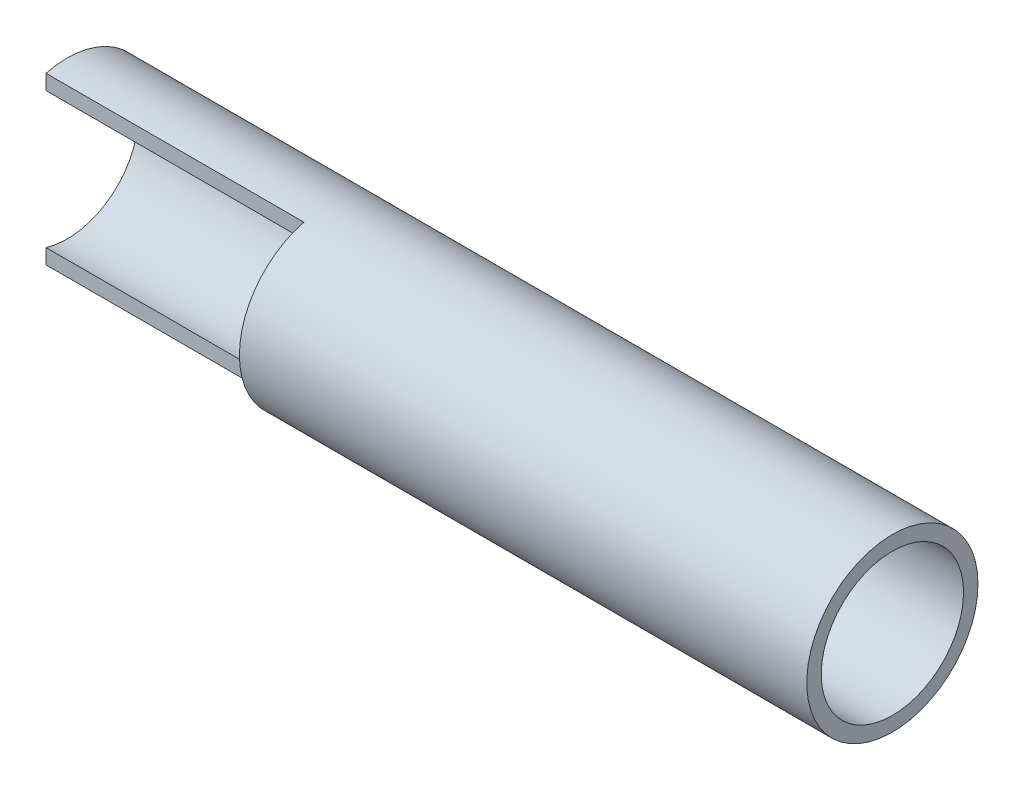
ISO-10303-21;
HEADER;
FILE_DESCRIPTION(('STEP AP214'),'2;1');
FILE_NAME('part.step','',(''),(''),'','','');
FILE_SCHEMA(('AUTOMOTIVE_DESIGN { 1 0 10303 214 1 1 1 1 }'));
ENDSEC;
DATA;
#1=APPLICATION_CONTEXT('core data for automotive mechanical design processes');
#2=APPLICATION_PROTOCOL_DEFINITION('international standard','automotive_design',2000,#1);
#3=PRODUCT_CONTEXT('',#1,'mechanical');
#4=PRODUCT('Part','Part','',(#3));
#5=PRODUCT_RELATED_PRODUCT_CATEGORY('part','',(#4));
#6=PRODUCT_DEFINITION_FORMATION('','',#4);
#7=PRODUCT_DEFINITION_CONTEXT('part definition',#1,'design');
#8=PRODUCT_DEFINITION('design','',#6,#7);
#9=PRODUCT_DEFINITION_SHAPE('','',#8);
#10=(LENGTH_UNIT() NAMED_UNIT(*) SI_UNIT(.MILLI.,.METRE.));
#11=(NAMED_UNIT(*) PLANE_ANGLE_UNIT() SI_UNIT($,.RADIAN.));
#12=(NAMED_UNIT(*) SI_UNIT($,.STERADIAN.) SOLID_ANGLE_UNIT());
#13=UNCERTAINTY_MEASURE_WITH_UNIT(LENGTH_MEASURE(1.E-05),#10,'distance_accuracy_value','');
#14=(GEOMETRIC_REPRESENTATION_CONTEXT(3) GLOBAL_UNCERTAINTY_ASSIGNED_CONTEXT((#13)) GLOBAL_UNIT_ASSIGNED_CONTEXT((#10,
#11,#12)) REPRESENTATION_CONTEXT('',''));
#15=CARTESIAN_POINT('',(0.,0.,0.));
#16=DIRECTION('',(0.,0.,1.));
#17=DIRECTION('',(1.,0.,0.));
#18=AXIS2_PLACEMENT_3D('',#15,#16,#17);
#19=CARTESIAN_POINT('',(-38.1,-21.082,21.082));
#20=DIRECTION('',(1.,0.,0.));
#21=DIRECTION('',(0.,0.,-1.));
#22=AXIS2_PLACEMENT_3D('',#19,#20,#21);
#23=PLANE('',#22);
#24=CARTESIAN_POINT('',(-38.1,0.,0.));
#25=DIRECTION('',(1.,0.,0.));
#26=DIRECTION('',(0.,0.,-1.));
#27=AXIS2_PLACEMENT_3D('',#24,#25,#26);
#28=CIRCLE('',#27,17.526);
#29=CARTESIAN_POINT('',(-38.1,16.7346295746276,5.20699999999984));
#30=VERTEX_POINT('',#29);
#31=CARTESIAN_POINT('',(-38.1,-16.7346295746281,5.207));
#32=VERTEX_POINT('',#31);
#33=EDGE_CURVE('E20',#30,#32,#28,.T.);
#34=ORIENTED_EDGE('',*,*,#33,.T.);
#35=DIRECTION('',(0.,1.,0.));
#36=VECTOR('',#35,1.);
#37=CARTESIAN_POINT('',(-38.1,-21.082,5.207));
#38=LINE('',#37,#36);
#39=CARTESIAN_POINT('',(-38.1,-20.4288490865247,5.20699999999991));
#40=VERTEX_POINT('',#39);
#41=EDGE_CURVE('E60',#32,#40,#38,.F.);
#42=ORIENTED_EDGE('',*,*,#41,.T.);
#43=CARTESIAN_POINT('',(-38.1,0.,0.));
#44=DIRECTION('',(1.,0.,0.));
#45=DIRECTION('',(0.,0.,-1.));
#46=AXIS2_PLACEMENT_3D('',#43,#44,#45);
#47=CIRCLE('',#46,21.082);
#48=CARTESIAN_POINT('',(-38.1,20.4288490865247,5.20699999999991));
#49=VERTEX_POINT('',#48);
#50=EDGE_CURVE('E118',#49,#40,#47,.T.);
#51=ORIENTED_EDGE('',*,*,#50,.F.);
#52=DIRECTION('',(0.,1.,0.));
#53=VECTOR('',#52,1.);
#54=CARTESIAN_POINT('',(-38.1,-21.082,5.207));
#55=LINE('',#54,#53);
#56=EDGE_CURVE('E55',#49,#30,#55,.F.);
#57=ORIENTED_EDGE('',*,*,#56,.T.);
#58=EDGE_LOOP('',(#34,#42,#51,#57));
#59=FACE_BOUND('',#58,.T.);
#60=ADVANCED_FACE('F17',(#59),#23,.F.);
#61=CARTESIAN_POINT('',(-38.1,-21.082,5.207));
#62=DIRECTION('',(0.,0.,-1.));
#63=DIRECTION('',(-1.,0.,0.));
#64=AXIS2_PLACEMENT_3D('',#61,#62,#63);
#65=PLANE('',#64);
#66=DIRECTION('',(0.,1.,0.));
#67=VECTOR('',#66,1.);
#68=CARTESIAN_POINT('',(-101.6,0.,5.207));
#69=LINE('',#68,#67);
#70=CARTESIAN_POINT('',(-101.6,20.4288490865247,5.20699999999991));
#71=VERTEX_POINT('',#70);
#72=CARTESIAN_POINT('',(-101.6,16.7346295746276,5.20699999999984));
#73=VERTEX_POINT('',#72);
#74=EDGE_CURVE('E117',#71,#73,#69,.F.);
#75=ORIENTED_EDGE('',*,*,#74,.T.);
#76=DIRECTION('',(1.,0.,0.));
#77=VECTOR('',#76,1.);
#78=CARTESIAN_POINT('',(-101.6,16.7346295746277,5.20699999999968));
#79=LINE('',#78,#77);
#80=EDGE_CURVE('E64',#73,#30,#79,.T.);
#81=ORIENTED_EDGE('',*,*,#80,.T.);
#82=ORIENTED_EDGE('',*,*,#56,.F.);
#83=DIRECTION('',(1.,0.,0.));
#84=VECTOR('',#83,1.);
#85=CARTESIAN_POINT('',(-101.6,20.4288490865247,5.20699999999982));
#86=LINE('',#85,#84);
#87=EDGE_CURVE('E113',#71,#49,#86,.T.);
#88=ORIENTED_EDGE('',*,*,#87,.F.);
#89=EDGE_LOOP('',(#75,#81,#82,#88));
#90=FACE_BOUND('',#89,.T.);
#91=ADVANCED_FACE('F116',(#90),#65,.F.);
#92=CARTESIAN_POINT('',(-38.1,-21.082,5.207));
#93=DIRECTION('',(0.,0.,-1.));
#94=DIRECTION('',(-1.,0.,0.));
#95=AXIS2_PLACEMENT_3D('',#92,#93,#94);
#96=PLANE('',#95);
#97=DIRECTION('',(0.,1.,0.));
#98=VECTOR('',#97,1.);
#99=CARTESIAN_POINT('',(-101.6,0.,5.207));
#100=LINE('',#99,#98);
#101=CARTESIAN_POINT('',(-101.6,-16.7346295746281,5.207));
#102=VERTEX_POINT('',#101);
#103=CARTESIAN_POINT('',(-101.6,-20.4288490865247,5.20699999999991));
#104=VERTEX_POINT('',#103);
#105=EDGE_CURVE('E121',#102,#104,#100,.F.);
#106=ORIENTED_EDGE('',*,*,#105,.T.);
#107=DIRECTION('',(1.,0.,0.));
#108=VECTOR('',#107,1.);
#109=CARTESIAN_POINT('',(-101.6,-20.4288490865247,5.20699999999982));
#110=LINE('',#109,#108);
#111=EDGE_CURVE('E74',#40,#104,#110,.F.);
#112=ORIENTED_EDGE('',*,*,#111,.F.);
#113=ORIENTED_EDGE('',*,*,#41,.F.);
#114=DIRECTION('',(-1.,0.,0.));
#115=VECTOR('',#114,1.);
#116=CARTESIAN_POINT('',(-38.1,-16.7346295746287,5.207));
#117=LINE('',#116,#115);
#118=EDGE_CURVE('E66',#102,#32,#117,.F.);
#119=ORIENTED_EDGE('',*,*,#118,.F.);
#120=EDGE_LOOP('',(#106,#112,#113,#119));
#121=FACE_BOUND('',#120,.T.);
#122=ADVANCED_FACE('F72',(#121),#96,.F.);
#123=CARTESIAN_POINT('',(-101.6,0.,0.));
#124=DIRECTION('',(1.,0.,0.));
#125=DIRECTION('',(0.,0.,-1.));
#126=AXIS2_PLACEMENT_3D('',#123,#124,#125);
#127=CYLINDRICAL_SURFACE('',#126,17.526);
#128=CARTESIAN_POINT('',(101.6,0.,0.));
#129=DIRECTION('',(1.,0.,0.));
#130=DIRECTION('',(0.,0.,-1.));
#131=AXIS2_PLACEMENT_3D('',#128,#129,#130);
#132=CIRCLE('',#131,17.526);
#133=CARTESIAN_POINT('',(101.6,0.,-17.526));
#134=VERTEX_POINT('',#133);
#135=EDGE_CURVE('E70',#134,#134,#132,.F.);
#136=ORIENTED_EDGE('',*,*,#135,.F.);
#137=EDGE_LOOP('',(#136));
#138=FACE_BOUND('',#137,.T.);
#139=CARTESIAN_POINT('',(-26.3017,0.,-17.526));
#140=CARTESIAN_POINT('',(-26.3016937733831,0.138938254931942,-17.5259977726248));
#141=CARTESIAN_POINT('',(-26.2900186932937,0.278056737041305,-17.5243291328847));
#142=CARTESIAN_POINT('',(-26.2436088529555,0.552510771760398,-17.5178292183779));
#143=CARTESIAN_POINT('',(-26.2088265731568,0.687837928648224,-17.512991426592));
#144=CARTESIAN_POINT('',(-26.1172536136485,0.950548988753152,-17.5006972156485));
#145=CARTESIAN_POINT('',(-26.0604879221809,1.07794172075063,-17.4932437705673));
#146=CARTESIAN_POINT('',(-25.9266136824874,1.32133653487949,-17.4765455887316));
#147=CARTESIAN_POINT('',(-25.8495132607084,1.4373431419368,-17.4673015679429));
#148=CARTESIAN_POINT('',(-25.6765639512212,1.65556227287108,-17.4479764750468));
#149=CARTESIAN_POINT('',(-25.5805984585312,1.75768195837013,-17.4378904336395));
#150=CARTESIAN_POINT('',(-25.3728896143282,1.94443010223313,-17.4180569830886));
#151=CARTESIAN_POINT('',(-25.2611445963793,2.02905671086871,-17.4083096098464));
#152=CARTESIAN_POINT('',(-25.0244473180547,2.1787595375816,-17.3902102827199));
#153=CARTESIAN_POINT('',(-24.8994394343284,2.2437486351899,-17.3818646180092));
#154=CARTESIAN_POINT('',(-24.6401457563648,2.35177419772773,-17.3675796065219));
#155=CARTESIAN_POINT('',(-24.5058604965408,2.39481192594698,-17.3616401212749));
#156=CARTESIAN_POINT('',(-24.2327799314474,2.45743213756116,-17.3528875502091));
#157=CARTESIAN_POINT('',(-24.0940210186794,2.47717037235337,-17.3500537131269));
#158=CARTESIAN_POINT('',(-23.8151334672967,2.49311360225913,-17.347770156121));
#159=CARTESIAN_POINT('',(-23.6750048973232,2.48931977072165,-17.3483202674678));
#160=CARTESIAN_POINT('',(-23.3984525067617,2.45843410030657,-17.3527234598054));
#161=CARTESIAN_POINT('',(-23.2620089154252,2.43151529098414,-17.3565520096389));
#162=CARTESIAN_POINT('',(-22.9955939060744,2.35541394562813,-17.3670424544746));
#163=CARTESIAN_POINT('',(-22.8656227094211,2.30623064871123,-17.3737044463084));
#164=CARTESIAN_POINT('',(-22.6153088916459,2.18681258648928,-17.3891387400983));
#165=CARTESIAN_POINT('',(-22.4950023509328,2.1165031963891,-17.3979185007095));
#166=CARTESIAN_POINT('',(-22.2678392220729,1.95688798280617,-17.4165926739363));
#167=CARTESIAN_POINT('',(-22.1609823572477,1.86758255019977,-17.4264870636145));
#168=CARTESIAN_POINT('',(-21.9627564206042,1.67157524535651,-17.4463829999866));
#169=CARTESIAN_POINT('',(-21.8715313454879,1.56472772059487,-17.4563847256321));
#170=CARTESIAN_POINT('',(-21.7082449037539,1.33710469447356,-17.4752924830594));
#171=CARTESIAN_POINT('',(-21.636192231748,1.21632290945262,-17.4841980167419));
#172=CARTESIAN_POINT('',(-21.5132980238316,0.964108046753344,-17.4999187345503));
#173=CARTESIAN_POINT('',(-21.4624843438644,0.83266124937718,-17.5067311703982));
#174=CARTESIAN_POINT('',(-21.3837965987208,0.563157851747397,-17.5174660851217));
#175=CARTESIAN_POINT('',(-21.3558740477745,0.425115880966424,-17.5213946704331));
#176=CARTESIAN_POINT('',(-21.3342823116666,0.238423058702268,-17.524443161174));
#177=CARTESIAN_POINT('',(-21.330167133619,0.190839329349159,-17.5250257692345));
#178=CARTESIAN_POINT('',(-21.3246749067218,0.0955108339760813,-17.5258045716289));
#179=CARTESIAN_POINT('',(-21.3232978593296,0.0477660678704186,-17.5260007657571));
#180=CARTESIAN_POINT('',(-21.3233062266169,-0.138938254931943,-17.5259977726248));
#181=CARTESIAN_POINT('',(-21.3349813067063,-0.278056737041307,-17.5243291328847));
#182=CARTESIAN_POINT('',(-21.3813911470445,-0.5525107717604,-17.5178292183779));
#183=CARTESIAN_POINT('',(-21.4161734268432,-0.687837928648226,-17.512991426592));
#184=CARTESIAN_POINT('',(-21.5077463863515,-0.950548988753155,-17.5006972156485));
#185=CARTESIAN_POINT('',(-21.5645120778191,-1.07794172075063,-17.4932437705673));
#186=CARTESIAN_POINT('',(-21.6983863175126,-1.32133653487949,-17.4765455887316));
#187=CARTESIAN_POINT('',(-21.7754867392916,-1.4373431419368,-17.4673015679429));
#188=CARTESIAN_POINT('',(-21.9484360487788,-1.65556227287108,-17.4479764750468));
#189=CARTESIAN_POINT('',(-22.0444015414688,-1.75768195837013,-17.4378904336395));
#190=CARTESIAN_POINT('',(-22.2521103856718,-1.94443010223313,-17.4180569830886));
#191=CARTESIAN_POINT('',(-22.3638554036207,-2.02905671086871,-17.4083096098464));
#192=CARTESIAN_POINT('',(-22.6005526819453,-2.1787595375816,-17.3902102827199));
#193=CARTESIAN_POINT('',(-22.7255605656716,-2.2437486351899,-17.3818646180092));
#194=CARTESIAN_POINT('',(-22.9848542436352,-2.35177419772773,-17.3675796065219));
#195=CARTESIAN_POINT('',(-23.1191395034592,-2.39481192594698,-17.3616401212749));
#196=CARTESIAN_POINT('',(-23.3922200685526,-2.45743213756116,-17.3528875502091));
#197=CARTESIAN_POINT('',(-23.5309789813206,-2.47717037235337,-17.3500537131269));
#198=CARTESIAN_POINT('',(-23.8098665327033,-2.49311360225913,-17.347770156121));
#199=CARTESIAN_POINT('',(-23.9499951026768,-2.48931977072165,-17.3483202674678));
#200=CARTESIAN_POINT('',(-24.2265474932383,-2.45843410030657,-17.3527234598054));
#201=CARTESIAN_POINT('',(-24.3629910845748,-2.43151529098414,-17.3565520096389));
#202=CARTESIAN_POINT('',(-24.6294060939256,-2.35541394562813,-17.3670424544746));
#203=CARTESIAN_POINT('',(-24.7593772905789,-2.30623064871123,-17.3737044463084));
#204=CARTESIAN_POINT('',(-25.0096911083541,-2.18681258648927,-17.3891387400983));
#205=CARTESIAN_POINT('',(-25.1299976490672,-2.1165031963891,-17.3979185007095));
#206=CARTESIAN_POINT('',(-25.3571607779271,-1.95688798280617,-17.4165926739363));
#207=CARTESIAN_POINT('',(-25.4640176427523,-1.86758255019977,-17.4264870636145));
#208=CARTESIAN_POINT('',(-25.6622435793958,-1.67157524535651,-17.4463829999866));
#209=CARTESIAN_POINT('',(-25.7534686545121,-1.56472772059487,-17.4563847256321));
#210=CARTESIAN_POINT('',(-25.9167550962461,-1.33710469447356,-17.4752924830594));
#211=CARTESIAN_POINT('',(-25.988807768252,-1.21632290945262,-17.4841980167419));
#212=CARTESIAN_POINT('',(-26.1117019761684,-0.964108046753343,-17.4999187345503));
#213=CARTESIAN_POINT('',(-26.1625156561356,-0.83266124937718,-17.5067311703982));
#214=CARTESIAN_POINT('',(-26.2412034012792,-0.563157851747396,-17.5174660851217));
#215=CARTESIAN_POINT('',(-26.2691259522255,-0.425115880966423,-17.5213946704331));
#216=CARTESIAN_POINT('',(-26.2907176883334,-0.238423058702268,-17.524443161174));
#217=CARTESIAN_POINT('',(-26.294832866381,-0.190839329349159,-17.5250257692345));
#218=CARTESIAN_POINT('',(-26.3003250932782,-0.0955108339760818,-17.5258045716289));
#219=CARTESIAN_POINT('',(-26.3017021406704,-0.0477660678704197,-17.5260007657571));
#220=CARTESIAN_POINT('',(-26.3017,0.,-17.526));
#221=B_SPLINE_CURVE_WITH_KNOTS('',3,(#139,#140,#141,#142,#143,#144,#145,#146,#147,#148,#149,
#150,#151,#152,#153,#154,#155,#156,#157,#158,#159,#160,#161,#162,#163,#164,#165,#166,#167,#168,
#169,#170,#171,#172,#173,#174,#175,#176,#177,#178,#179,#180,#181,#182,#183,#184,#185,#186,#187,
#188,#189,#190,#191,#192,#193,#194,#195,#196,#197,#198,#199,#200,#201,#202,#203,#204,#205,#206,
#207,#208,#209,#210,#211,#212,#213,#214,#215,#216,#217,#218,#219,#220),.UNSPECIFIED.,.T.,.F.,(4,
2,2,2,2,2,2,2,2,2,2,2,2,2,2,2,2,2,2,2,2,2,2,2,2,2,2,2,2,2,2,2,2,2,2,2,2,2,2,2,4),(0.,
0.416632621256299,0.834124703436849,1.25114361445183,1.66799612244714,2.08751115533074,
2.50707052531723,2.92846479975324,3.34983482043377,3.76837184084957,4.18688799246334,
4.60229965981692,5.01772552483292,5.43463642470699,5.85153874674943,6.27209610359054,
6.69284385779426,7.11414172405143,7.53454491553812,7.67778042315222,7.82101600699993,
8.23764862825623,8.65514071043678,9.07215962145177,9.48901212944708,9.90852716233067,
10.3280865323172,10.7494808067532,11.1708508274337,11.5893878478495,12.0079039994633,
12.4233156668169,12.8387415318329,13.2556524317069,13.6725547537494,14.0931121105905,
14.5138598647942,14.9351577310514,15.355560922538,15.4987964301521,15.6420320139999),.UNSPECIFIED.);
#222=CARTESIAN_POINT('',(-26.3017,0.,-17.526));
#223=VERTEX_POINT('',#222);
#224=EDGE_CURVE('E136',#223,#223,#221,.T.);
#225=ORIENTED_EDGE('',*,*,#224,.T.);
#226=EDGE_LOOP('',(#225));
#227=FACE_BOUND('',#226,.T.);
#228=CARTESIAN_POINT('',(21.3233,0.,-17.526));
#229=CARTESIAN_POINT('',(21.3233062266169,0.138938254931941,-17.5259977726248));
#230=CARTESIAN_POINT('',(21.3349813067063,0.278056737041304,-17.5243291328847));
#231=CARTESIAN_POINT('',(21.3813911470445,0.552510771760397,-17.5178292183779));
#232=CARTESIAN_POINT('',(21.4161734268432,0.687837928648223,-17.512991426592));
#233=CARTESIAN_POINT('',(21.5077463863515,0.950548988753152,-17.5006972156485));
#234=CARTESIAN_POINT('',(21.5645120778191,1.07794172075063,-17.4932437705673));
#235=CARTESIAN_POINT('',(21.6983863175126,1.32133653487949,-17.4765455887316));
#236=CARTESIAN_POINT('',(21.7754867392916,1.4373431419368,-17.4673015679429));
#237=CARTESIAN_POINT('',(21.9484360487788,1.65556227287108,-17.4479764750468));
#238=CARTESIAN_POINT('',(22.0444015414688,1.75768195837013,-17.4378904336395));
#239=CARTESIAN_POINT('',(22.2521103856718,1.94443010223313,-17.4180569830886));
#240=CARTESIAN_POINT('',(22.3638554036207,2.02905671086871,-17.4083096098464));
#241=CARTESIAN_POINT('',(22.6005526819453,2.17875953758159,-17.3902102827199));
#242=CARTESIAN_POINT('',(22.7255605656716,2.2437486351899,-17.3818646180092));
#243=CARTESIAN_POINT('',(22.9848542436352,2.35177419772773,-17.3675796065219));
#244=CARTESIAN_POINT('',(23.1191395034592,2.39481192594698,-17.3616401212749));
#245=CARTESIAN_POINT('',(23.3922200685526,2.45743213756116,-17.3528875502091));
#246=CARTESIAN_POINT('',(23.5309789813206,2.47717037235337,-17.3500537131269));
#247=CARTESIAN_POINT('',(23.8098665327033,2.49311360225913,-17.347770156121));
#248=CARTESIAN_POINT('',(23.9499951026768,2.48931977072165,-17.3483202674678));
#249=CARTESIAN_POINT('',(24.2265474932383,2.45843410030657,-17.3527234598054));
#250=CARTESIAN_POINT('',(24.3629910845748,2.43151529098414,-17.3565520096389));
#251=CARTESIAN_POINT('',(24.6294060939256,2.35541394562813,-17.3670424544746));
#252=CARTESIAN_POINT('',(24.7593772905789,2.30623064871123,-17.3737044463084));
#253=CARTESIAN_POINT('',(25.0096911083541,2.18681258648928,-17.3891387400983));
#254=CARTESIAN_POINT('',(25.1299976490672,2.1165031963891,-17.3979185007095));
#255=CARTESIAN_POINT('',(25.3571607779271,1.95688798280617,-17.4165926739363));
#256=CARTESIAN_POINT('',(25.4640176427523,1.86758255019977,-17.4264870636145));
#257=CARTESIAN_POINT('',(25.6622435793958,1.67157524535651,-17.4463829999866));
#258=CARTESIAN_POINT('',(25.7534686545121,1.56472772059487,-17.4563847256321));
#259=CARTESIAN_POINT('',(25.9167550962461,1.33710469447357,-17.4752924830594));
#260=CARTESIAN_POINT('',(25.988807768252,1.21632290945263,-17.4841980167419));
#261=CARTESIAN_POINT('',(26.1117019761684,0.964108046753346,-17.4999187345503));
#262=CARTESIAN_POINT('',(26.1625156561356,0.832661249377182,-17.5067311703982));
#263=CARTESIAN_POINT('',(26.2412034012792,0.563157851747397,-17.5174660851217));
#264=CARTESIAN_POINT('',(26.2691259522255,0.425115880966424,-17.5213946704331));
#265=CARTESIAN_POINT('',(26.2907176883334,0.238423058702268,-17.524443161174));
#266=CARTESIAN_POINT('',(26.294832866381,0.190839329349158,-17.5250257692345));
#267=CARTESIAN_POINT('',(26.3003250932782,0.0955108339760807,-17.5258045716289));
#268=CARTESIAN_POINT('',(26.3017021406704,0.0477660678704185,-17.5260007657571));
#269=CARTESIAN_POINT('',(26.3016937733831,-0.138938254931943,-17.5259977726248));
#270=CARTESIAN_POINT('',(26.2900186932937,-0.278056737041306,-17.5243291328847));
#271=CARTESIAN_POINT('',(26.2436088529555,-0.552510771760399,-17.5178292183779));
#272=CARTESIAN_POINT('',(26.2088265731568,-0.687837928648225,-17.512991426592));
#273=CARTESIAN_POINT('',(26.1172536136485,-0.950548988753154,-17.5006972156485));
#274=CARTESIAN_POINT('',(26.0604879221809,-1.07794172075063,-17.4932437705673));
#275=CARTESIAN_POINT('',(25.9266136824874,-1.32133653487949,-17.4765455887316));
#276=CARTESIAN_POINT('',(25.8495132607084,-1.4373431419368,-17.4673015679429));
#277=CARTESIAN_POINT('',(25.6765639512212,-1.65556227287108,-17.4479764750468));
#278=CARTESIAN_POINT('',(25.5805984585312,-1.75768195837013,-17.4378904336395));
#279=CARTESIAN_POINT('',(25.3728896143282,-1.94443010223313,-17.4180569830886));
#280=CARTESIAN_POINT('',(25.2611445963793,-2.02905671086871,-17.4083096098464));
#281=CARTESIAN_POINT('',(25.0244473180547,-2.1787595375816,-17.3902102827199));
#282=CARTESIAN_POINT('',(24.8994394343284,-2.2437486351899,-17.3818646180092));
#283=CARTESIAN_POINT('',(24.6401457563648,-2.35177419772773,-17.3675796065219));
#284=CARTESIAN_POINT('',(24.5058604965408,-2.39481192594698,-17.3616401212749));
#285=CARTESIAN_POINT('',(24.2327799314474,-2.45743213756116,-17.3528875502091));
#286=CARTESIAN_POINT('',(24.0940210186794,-2.47717037235337,-17.3500537131269));
#287=CARTESIAN_POINT('',(23.8151334672967,-2.49311360225913,-17.347770156121));
#288=CARTESIAN_POINT('',(23.6750048973232,-2.48931977072165,-17.3483202674678));
#289=CARTESIAN_POINT('',(23.3984525067617,-2.45843410030657,-17.3527234598054));
#290=CARTESIAN_POINT('',(23.2620089154252,-2.43151529098414,-17.3565520096389));
#291=CARTESIAN_POINT('',(22.9955939060744,-2.35541394562813,-17.3670424544746));
#292=CARTESIAN_POINT('',(22.8656227094211,-2.30623064871123,-17.3737044463084));
#293=CARTESIAN_POINT('',(22.6153088916459,-2.18681258648928,-17.3891387400983));
#294=CARTESIAN_POINT('',(22.4950023509328,-2.1165031963891,-17.3979185007095));
#295=CARTESIAN_POINT('',(22.2678392220729,-1.95688798280617,-17.4165926739363));
#296=CARTESIAN_POINT('',(22.1609823572477,-1.86758255019977,-17.4264870636145));
#297=CARTESIAN_POINT('',(21.9627564206042,-1.67157524535651,-17.4463829999866));
#298=CARTESIAN_POINT('',(21.8715313454879,-1.56472772059487,-17.4563847256321));
#299=CARTESIAN_POINT('',(21.7082449037539,-1.33710469447356,-17.4752924830594));
#300=CARTESIAN_POINT('',(21.636192231748,-1.21632290945262,-17.4841980167419));
#301=CARTESIAN_POINT('',(21.5132980238316,-0.964108046753343,-17.4999187345503));
#302=CARTESIAN_POINT('',(21.4624843438644,-0.832661249377179,-17.5067311703982));
#303=CARTESIAN_POINT('',(21.3837965987208,-0.563157851747396,-17.5174660851217));
#304=CARTESIAN_POINT('',(21.3558740477745,-0.425115880966423,-17.5213946704331));
#305=CARTESIAN_POINT('',(21.3342823116666,-0.238423058702267,-17.524443161174));
#306=CARTESIAN_POINT('',(21.330167133619,-0.190839329349158,-17.5250257692345));
#307=CARTESIAN_POINT('',(21.3246749067218,-0.095510833976081,-17.5258045716289));
#308=CARTESIAN_POINT('',(21.3232978593296,-0.0477660678704194,-17.5260007657571));
#309=CARTESIAN_POINT('',(21.3233,0.,-17.526));
#310=B_SPLINE_CURVE_WITH_KNOTS('',3,(#228,#229,#230,#231,#232,#233,#234,#235,#236,#237,#238,
#239,#240,#241,#242,#243,#244,#245,#246,#247,#248,#249,#250,#251,#252,#253,#254,#255,#256,#257,
#258,#259,#260,#261,#262,#263,#264,#265,#266,#267,#268,#269,#270,#271,#272,#273,#274,#275,#276,
#277,#278,#279,#280,#281,#282,#283,#284,#285,#286,#287,#288,#289,#290,#291,#292,#293,#294,#295,
#296,#297,#298,#299,#300,#301,#302,#303,#304,#305,#306,#307,#308,#309),.UNSPECIFIED.,.T.,.F.,(4,
2,2,2,2,2,2,2,2,2,2,2,2,2,2,2,2,2,2,2,2,2,2,2,2,2,2,2,2,2,2,2,2,2,2,2,2,2,2,2,4),(0.,
0.416632621256298,0.834124703436848,1.25114361445183,1.66799612244714,2.08751115533074,
2.50707052531723,2.92846479975324,3.34983482043377,3.76837184084956,4.18688799246334,
4.60229965981692,5.01772552483292,5.43463642470698,5.85153874674943,6.27209610359054,
6.69284385779425,7.11414172405143,7.53454491553812,7.67778042315222,7.82101600699993,
8.23764862825623,8.65514071043678,9.07215962145177,9.48901212944707,9.90852716233067,
10.3280865323172,10.7494808067532,11.1708508274337,11.5893878478495,12.0079039994633,
12.4233156668168,12.8387415318329,13.2556524317069,13.6725547537494,14.0931121105905,
14.5138598647942,14.9351577310514,15.355560922538,15.4987964301521,15.6420320139999),.UNSPECIFIED.);
#311=CARTESIAN_POINT('',(21.3233,0.,-17.526));
#312=VERTEX_POINT('',#311);
#313=EDGE_CURVE('E130',#312,#312,#310,.T.);
#314=ORIENTED_EDGE('',*,*,#313,.T.);
#315=EDGE_LOOP('',(#314));
#316=FACE_BOUND('',#315,.T.);
#317=ORIENTED_EDGE('',*,*,#80,.F.);
#318=CARTESIAN_POINT('',(-101.6,0.,0.));
#319=DIRECTION('',(1.,0.,0.));
#320=DIRECTION('',(0.,0.,-1.));
#321=AXIS2_PLACEMENT_3D('',#318,#319,#320);
#322=CIRCLE('',#321,17.526);
#323=EDGE_CURVE('E68',#73,#102,#322,.F.);
#324=ORIENTED_EDGE('',*,*,#323,.T.);
#325=ORIENTED_EDGE('',*,*,#118,.T.);
#326=ORIENTED_EDGE('',*,*,#33,.F.);
#327=EDGE_LOOP('',(#317,#324,#325,#326));
#328=FACE_BOUND('',#327,.T.);
#329=ADVANCED_FACE('F67',(#138,#227,#316,#328),#127,.F.);
#330=CARTESIAN_POINT('',(101.6,0.,0.));
#331=DIRECTION('',(1.,0.,0.));
#332=DIRECTION('',(0.,0.,-1.));
#333=AXIS2_PLACEMENT_3D('',#330,#331,#332);
#334=PLANE('',#333);
#335=ORIENTED_EDGE('',*,*,#135,.T.);
#336=EDGE_LOOP('',(#335));
#337=FACE_BOUND('',#336,.T.);
#338=CARTESIAN_POINT('',(101.6,0.,0.));
#339=DIRECTION('',(1.,0.,0.));
#340=DIRECTION('',(0.,0.,-1.));
#341=AXIS2_PLACEMENT_3D('',#338,#339,#340);
#342=CIRCLE('',#341,21.082);
#343=CARTESIAN_POINT('',(101.6,0.,-21.082));
#344=VERTEX_POINT('',#343);
#345=EDGE_CURVE('E105',#344,#344,#342,.F.);
#346=ORIENTED_EDGE('',*,*,#345,.F.);
#347=EDGE_LOOP('',(#346));
#348=FACE_BOUND('',#347,.T.);
#349=ADVANCED_FACE('F149',(#337,#348),#334,.T.);
#350=CARTESIAN_POINT('',(-101.6,0.,0.));
#351=DIRECTION('',(1.,0.,0.));
#352=DIRECTION('',(0.,0.,-1.));
#353=AXIS2_PLACEMENT_3D('',#350,#351,#352);
#354=PLANE('',#353);
#355=CARTESIAN_POINT('',(-101.6,0.,0.));
#356=DIRECTION('',(1.,0.,0.));
#357=DIRECTION('',(0.,0.,-1.));
#358=AXIS2_PLACEMENT_3D('',#355,#356,#357);
#359=CIRCLE('',#358,21.082);
#360=EDGE_CURVE('E35',#104,#71,#359,.T.);
#361=ORIENTED_EDGE('',*,*,#360,.F.);
#362=ORIENTED_EDGE('',*,*,#105,.F.);
#363=ORIENTED_EDGE('',*,*,#323,.F.);
#364=ORIENTED_EDGE('',*,*,#74,.F.);
#365=EDGE_LOOP('',(#361,#362,#363,#364));
#366=FACE_BOUND('',#365,.T.);
#367=ADVANCED_FACE('F119',(#366),#354,.F.);
#368=CARTESIAN_POINT('',(23.8125,0.,0.));
#369=DIRECTION('',(0.,0.,-1.));
#370=DIRECTION('',(-1.,0.,0.));
#371=AXIS2_PLACEMENT_3D('',#368,#369,#370);
#372=CYLINDRICAL_SURFACE('',#371,2.4892);
#373=ORIENTED_EDGE('',*,*,#313,.F.);
#374=EDGE_LOOP('',(#373));
#375=FACE_BOUND('',#374,.T.);
#376=CARTESIAN_POINT('',(21.3233,0.,-21.082));
#377=CARTESIAN_POINT('',(21.3233060906864,-0.139173242536472,-21.0819981655476));
#378=CARTESIAN_POINT('',(21.3350204161184,-0.278529433631495,-21.0806062227581));
#379=CARTESIAN_POINT('',(21.3815935900689,-0.553464384706545,-21.0751843948127));
#380=CARTESIAN_POINT('',(21.416500711719,-0.689034650147754,-21.0711490078797));
#381=CARTESIAN_POINT('',(21.5084246514525,-0.952234680958765,-21.0608949848637));
#382=CARTESIAN_POINT('',(21.5654183852768,-1.07987257591295,-21.0546786289036));
#383=CARTESIAN_POINT('',(21.6998511309229,-1.32371155335375,-21.0407567449483));
#384=CARTESIAN_POINT('',(21.7772815164615,-1.43991743293608,-21.0330518456322));
#385=CARTESIAN_POINT('',(21.9508139744304,-1.65824366359407,-21.0169694889126));
#386=CARTESIAN_POINT('',(22.0469984901312,-1.7602982861813,-21.008589161403));
#387=CARTESIAN_POINT('',(22.2551363410809,-1.94686149327507,-20.9921234801541));
#388=CARTESIAN_POINT('',(22.3670912357826,-2.03136834052417,-20.9840381556858));
#389=CARTESIAN_POINT('',(22.6039996271426,-2.18066596797703,-20.9690506836339));
#390=CARTESIAN_POINT('',(22.7289907466025,-2.24539743866397,-20.9621521218544));
#391=CARTESIAN_POINT('',(22.988163220943,-2.35292726459425,-20.9503556287517));
#392=CARTESIAN_POINT('',(23.1223441834819,-2.39572655552658,-20.9454576120813));
#393=CARTESIAN_POINT('',(23.3954241517531,-2.45798388401387,-20.9382431663173));
#394=CARTESIAN_POINT('',(23.5342982012986,-2.47754997869918,-20.9359147894799));
#395=CARTESIAN_POINT('',(23.8133771335117,-2.49311975385867,-20.9340665629629));
#396=CARTESIAN_POINT('',(23.9535819703898,-2.48912424212237,-20.9345466169986));
#397=CARTESIAN_POINT('',(24.2305904226035,-2.45777309723949,-20.9382500748012));
#398=CARTESIAN_POINT('',(24.3674077109805,-2.43053639079988,-20.9414595118558));
#399=CARTESIAN_POINT('',(24.6345171243116,-2.35366098786401,-20.9502383704882));
#400=CARTESIAN_POINT('',(24.7648090719799,-2.30402168308216,-20.9558078561469));
#401=CARTESIAN_POINT('',(25.0155434543351,-2.18361936461013,-20.9686954057668));
#402=CARTESIAN_POINT('',(25.1359603428303,-2.11280363705816,-20.9760178240728));
#403=CARTESIAN_POINT('',(25.3632358420088,-1.95210261660065,-20.9915819783994));
#404=CARTESIAN_POINT('',(25.4700950027098,-1.86221809768415,-20.9998236771006));
#405=CARTESIAN_POINT('',(25.6679044081532,-1.66528844379043,-21.0163588445672));
#406=CARTESIAN_POINT('',(25.7587558145381,-1.55814401335078,-21.0246523285127));
#407=CARTESIAN_POINT('',(25.9212416850519,-1.33001488761702,-21.0403144982853));
#408=CARTESIAN_POINT('',(25.9928673200475,-1.20902386975035,-21.0476827583939));
#409=CARTESIAN_POINT('',(26.1148595049235,-0.956530753400542,-21.0606687789238));
#410=CARTESIAN_POINT('',(26.1652026123001,-0.825017253075607,-21.0662846072851));
#411=CARTESIAN_POINT('',(26.2429591659781,-0.555500835671915,-21.0751091304543));
#412=CARTESIAN_POINT('',(26.2704211810119,-0.417512324356256,-21.0783229224621));
#413=CARTESIAN_POINT('',(26.2912887117282,-0.232154861972337,-21.0807729691146));
#414=CARTESIAN_POINT('',(26.2951900178503,-0.185816598413803,-21.0812321786978));
#415=CARTESIAN_POINT('',(26.3003966800405,-0.0929923662024419,-21.0818460006914));
#416=CARTESIAN_POINT('',(26.3017020352754,-0.046506397502219,-21.0820006130041));
#417=CARTESIAN_POINT('',(26.3016939093136,0.13917324253647,-21.0819981655476));
#418=CARTESIAN_POINT('',(26.2899795838816,0.278529433631494,-21.0806062227581));
#419=CARTESIAN_POINT('',(26.2434064099311,0.553464384706543,-21.0751843948127));
#420=CARTESIAN_POINT('',(26.208499288281,0.689034650147752,-21.0711490078797));
#421=CARTESIAN_POINT('',(26.1165753485475,0.952234680958763,-21.0608949848637));
#422=CARTESIAN_POINT('',(26.0595816147232,1.07987257591295,-21.0546786289036));
#423=CARTESIAN_POINT('',(25.9251488690771,1.32371155335375,-21.0407567449483));
#424=CARTESIAN_POINT('',(25.8477184835385,1.43991743293608,-21.0330518456322));
#425=CARTESIAN_POINT('',(25.6741860255696,1.65824366359407,-21.0169694889126));
#426=CARTESIAN_POINT('',(25.5780015098688,1.76029828618129,-21.008589161403));
#427=CARTESIAN_POINT('',(25.3698636589191,1.94686149327507,-20.9921234801541));
#428=CARTESIAN_POINT('',(25.2579087642175,2.03136834052416,-20.9840381556858));
#429=CARTESIAN_POINT('',(25.0210003728574,2.18066596797703,-20.9690506836339));
#430=CARTESIAN_POINT('',(24.8960092533975,2.24539743866397,-20.9621521218544));
#431=CARTESIAN_POINT('',(24.636836779057,2.35292726459425,-20.9503556287517));
#432=CARTESIAN_POINT('',(24.5026558165181,2.39572655552658,-20.9454576120813));
#433=CARTESIAN_POINT('',(24.229575848247,2.45798388401387,-20.9382431663173));
#434=CARTESIAN_POINT('',(24.0907017987014,2.47754997869918,-20.9359147894799));
#435=CARTESIAN_POINT('',(23.8116228664883,2.49311975385867,-20.9340665629629));
#436=CARTESIAN_POINT('',(23.6714180296102,2.48912424212237,-20.9345466169986));
#437=CARTESIAN_POINT('',(23.3944095773965,2.45777309723949,-20.9382500748012));
#438=CARTESIAN_POINT('',(23.2575922890195,2.43053639079988,-20.9414595118558));
#439=CARTESIAN_POINT('',(22.9904828756884,2.35366098786401,-20.9502383704882));
#440=CARTESIAN_POINT('',(22.8601909280201,2.30402168308216,-20.9558078561469));
#441=CARTESIAN_POINT('',(22.6094565456649,2.18361936461013,-20.9686954057668));
#442=CARTESIAN_POINT('',(22.4890396571697,2.11280363705816,-20.9760178240728));
#443=CARTESIAN_POINT('',(22.2617641579912,1.95210261660065,-20.9915819783994));
#444=CARTESIAN_POINT('',(22.1549049972902,1.86221809768415,-20.9998236771006));
#445=CARTESIAN_POINT('',(21.9570955918468,1.66528844379043,-21.0163588445672));
#446=CARTESIAN_POINT('',(21.8662441854619,1.55814401335078,-21.0246523285127));
#447=CARTESIAN_POINT('',(21.7037583149481,1.33001488761702,-21.0403144982853));
#448=CARTESIAN_POINT('',(21.6321326799525,1.20902386975035,-21.0476827583939));
#449=CARTESIAN_POINT('',(21.5101404950765,0.956530753400546,-21.0606687789238));
#450=CARTESIAN_POINT('',(21.4597973876999,0.825017253075611,-21.0662846072851));
#451=CARTESIAN_POINT('',(21.3820408340219,0.555500835671919,-21.0751091304543));
#452=CARTESIAN_POINT('',(21.3545788189882,0.417512324356259,-21.0783229224621));
#453=CARTESIAN_POINT('',(21.3337112882718,0.232154861972339,-21.0807729691146));
#454=CARTESIAN_POINT('',(21.3298099821497,0.185816598413805,-21.0812321786978));
#455=CARTESIAN_POINT('',(21.3246033199595,0.0929923662024423,-21.0818460006914));
#456=CARTESIAN_POINT('',(21.3232979647246,0.0465063975022184,-21.0820006130041));
#457=CARTESIAN_POINT('',(21.3233,0.,-21.082));
#458=B_SPLINE_CURVE_WITH_KNOTS('',3,(#376,#377,#378,#379,#380,#381,#382,#383,#384,#385,#386,
#387,#388,#389,#390,#391,#392,#393,#394,#395,#396,#397,#398,#399,#400,#401,#402,#403,#404,#405,
#406,#407,#408,#409,#410,#411,#412,#413,#414,#415,#416,#417,#418,#419,#420,#421,#422,#423,#424,
#425,#426,#427,#428,#429,#430,#431,#432,#433,#434,#435,#436,#437,#438,#439,#440,#441,#442,#443,
#444,#445,#446,#447,#448,#449,#450,#451,#452,#453,#454,#455,#456,#457),.UNSPECIFIED.,.T.,.F.,(4,
2,2,2,2,2,2,2,2,2,2,2,2,2,2,2,2,2,2,2,2,2,2,2,2,2,2,2,2,2,2,2,2,2,2,2,2,2,2,2,4),(0.,
0.417342531698612,0.835556446393463,1.25333443033391,1.67093635198848,2.09041721847861,
2.50993959445756,2.93070810484588,3.35145866256164,3.7702445557489,4.1890160913035,
4.60565750829793,5.02231023881106,5.44000888913395,5.85769058860035,6.27786714988648,
6.69823634180109,7.11906736753134,7.53900282062446,7.6784627562516,7.81792273663304,
8.23526526833165,8.6534791830265,9.07125716696695,9.48885908862152,9.90833995511164,
10.3278623310906,10.7486308414789,11.1693813991947,11.5881672923819,12.0069388279365,
12.423580244931,12.8402329754441,13.257931625767,13.6756133252334,14.0957898865195,
14.5161590784341,14.9369901041644,15.3569255572575,15.4963854928846,15.6358454732661),.UNSPECIFIED.);
#459=CARTESIAN_POINT('',(21.3233,0.,-21.082));
#460=VERTEX_POINT('',#459);
#461=EDGE_CURVE('E26',#460,#460,#458,.T.);
#462=ORIENTED_EDGE('',*,*,#461,.F.);
#463=EDGE_LOOP('',(#462));
#464=FACE_BOUND('',#463,.T.);
#465=ADVANCED_FACE('F100',(#375,#464),#372,.F.);
#466=CARTESIAN_POINT('',(-23.8125,0.,0.));
#467=DIRECTION('',(0.,0.,1.));
#468=DIRECTION('',(1.,0.,0.));
#469=AXIS2_PLACEMENT_3D('',#466,#467,#468);
#470=CYLINDRICAL_SURFACE('',#469,2.4892);
#471=CARTESIAN_POINT('',(-26.3017,0.,-21.082));
#472=CARTESIAN_POINT('',(-26.3016939093136,-0.139173242536471,-21.0819981655476));
#473=CARTESIAN_POINT('',(-26.2899795838816,-0.278529433631495,-21.0806062227581));
#474=CARTESIAN_POINT('',(-26.2434064099311,-0.553464384706545,-21.0751843948127));
#475=CARTESIAN_POINT('',(-26.208499288281,-0.689034650147754,-21.0711490078797));
#476=CARTESIAN_POINT('',(-26.1165753485475,-0.952234680958766,-21.0608949848637));
#477=CARTESIAN_POINT('',(-26.0595816147232,-1.07987257591295,-21.0546786289036));
#478=CARTESIAN_POINT('',(-25.9251488690771,-1.32371155335375,-21.0407567449483));
#479=CARTESIAN_POINT('',(-25.8477184835385,-1.43991743293608,-21.0330518456322));
#480=CARTESIAN_POINT('',(-25.6741860255696,-1.65824366359407,-21.0169694889126));
#481=CARTESIAN_POINT('',(-25.5780015098688,-1.7602982861813,-21.008589161403));
#482=CARTESIAN_POINT('',(-25.3698636589191,-1.94686149327508,-20.9921234801541));
#483=CARTESIAN_POINT('',(-25.2579087642174,-2.03136834052417,-20.9840381556858));
#484=CARTESIAN_POINT('',(-25.0210003728574,-2.18066596797703,-20.9690506836339));
#485=CARTESIAN_POINT('',(-24.8960092533975,-2.24539743866397,-20.9621521218544));
#486=CARTESIAN_POINT('',(-24.636836779057,-2.35292726459425,-20.9503556287517));
#487=CARTESIAN_POINT('',(-24.5026558165181,-2.39572655552658,-20.9454576120813));
#488=CARTESIAN_POINT('',(-24.2295758482469,-2.45798388401387,-20.9382431663173));
#489=CARTESIAN_POINT('',(-24.0907017987014,-2.47754997869918,-20.9359147894799));
#490=CARTESIAN_POINT('',(-23.8116228664883,-2.49311975385867,-20.9340665629629));
#491=CARTESIAN_POINT('',(-23.6714180296102,-2.48912424212237,-20.9345466169986));
#492=CARTESIAN_POINT('',(-23.3944095773965,-2.45777309723949,-20.9382500748012));
#493=CARTESIAN_POINT('',(-23.2575922890195,-2.43053639079988,-20.9414595118558));
#494=CARTESIAN_POINT('',(-22.9904828756884,-2.35366098786401,-20.9502383704882));
#495=CARTESIAN_POINT('',(-22.8601909280201,-2.30402168308216,-20.9558078561469));
#496=CARTESIAN_POINT('',(-22.6094565456649,-2.18361936461013,-20.9686954057668));
#497=CARTESIAN_POINT('',(-22.4890396571697,-2.11280363705816,-20.9760178240728));
#498=CARTESIAN_POINT('',(-22.2617641579912,-1.95210261660065,-20.9915819783994));
#499=CARTESIAN_POINT('',(-22.1549049972902,-1.86221809768415,-20.9998236771006));
#500=CARTESIAN_POINT('',(-21.9570955918468,-1.66528844379043,-21.0163588445672));
#501=CARTESIAN_POINT('',(-21.8662441854619,-1.55814401335078,-21.0246523285127));
#502=CARTESIAN_POINT('',(-21.7037583149481,-1.33001488761702,-21.0403144982853));
#503=CARTESIAN_POINT('',(-21.6321326799525,-1.20902386975035,-21.0476827583939));
#504=CARTESIAN_POINT('',(-21.5101404950765,-0.956530753400542,-21.0606687789238));
#505=CARTESIAN_POINT('',(-21.4597973876999,-0.825017253075607,-21.0662846072851));
#506=CARTESIAN_POINT('',(-21.3820408340219,-0.555500835671915,-21.0751091304543));
#507=CARTESIAN_POINT('',(-21.3545788189881,-0.417512324356256,-21.0783229224621));
#508=CARTESIAN_POINT('',(-21.3337112882718,-0.232154861972337,-21.0807729691146));
#509=CARTESIAN_POINT('',(-21.3298099821497,-0.185816598413803,-21.0812321786978));
#510=CARTESIAN_POINT('',(-21.3246033199595,-0.0929923662024421,-21.0818460006914));
#511=CARTESIAN_POINT('',(-21.3232979647246,-0.0465063975022193,-21.0820006130041));
#512=CARTESIAN_POINT('',(-21.3233060906864,0.13917324253647,-21.0819981655476));
#513=CARTESIAN_POINT('',(-21.3350204161184,0.278529433631494,-21.0806062227581));
#514=CARTESIAN_POINT('',(-21.3815935900689,0.553464384706544,-21.0751843948127));
#515=CARTESIAN_POINT('',(-21.416500711719,0.689034650147752,-21.0711490078797));
#516=CARTESIAN_POINT('',(-21.5084246514525,0.952234680958763,-21.0608949848637));
#517=CARTESIAN_POINT('',(-21.5654183852768,1.07987257591295,-21.0546786289036));
#518=CARTESIAN_POINT('',(-21.6998511309229,1.32371155335375,-21.0407567449483));
#519=CARTESIAN_POINT('',(-21.7772815164615,1.43991743293608,-21.0330518456322));
#520=CARTESIAN_POINT('',(-21.9508139744304,1.65824366359407,-21.0169694889126));
#521=CARTESIAN_POINT('',(-22.0469984901312,1.76029828618129,-21.008589161403));
#522=CARTESIAN_POINT('',(-22.2551363410809,1.94686149327507,-20.9921234801541));
#523=CARTESIAN_POINT('',(-22.3670912357825,2.03136834052416,-20.9840381556858));
#524=CARTESIAN_POINT('',(-22.6039996271426,2.18066596797703,-20.9690506836339));
#525=CARTESIAN_POINT('',(-22.7289907466025,2.24539743866396,-20.9621521218544));
#526=CARTESIAN_POINT('',(-22.988163220943,2.35292726459425,-20.9503556287517));
#527=CARTESIAN_POINT('',(-23.1223441834819,2.39572655552658,-20.9454576120813));
#528=CARTESIAN_POINT('',(-23.3954241517531,2.45798388401387,-20.9382431663173));
#529=CARTESIAN_POINT('',(-23.5342982012986,2.47754997869918,-20.9359147894799));
#530=CARTESIAN_POINT('',(-23.8133771335117,2.49311975385867,-20.9340665629629));
#531=CARTESIAN_POINT('',(-23.9535819703898,2.48912424212237,-20.9345466169986));
#532=CARTESIAN_POINT('',(-24.2305904226035,2.45777309723949,-20.9382500748012));
#533=CARTESIAN_POINT('',(-24.3674077109805,2.43053639079988,-20.9414595118558));
#534=CARTESIAN_POINT('',(-24.6345171243116,2.35366098786401,-20.9502383704882));
#535=CARTESIAN_POINT('',(-24.7648090719799,2.30402168308216,-20.9558078561469));
#536=CARTESIAN_POINT('',(-25.0155434543351,2.18361936461013,-20.9686954057668));
#537=CARTESIAN_POINT('',(-25.1359603428303,2.11280363705816,-20.9760178240728));
#538=CARTESIAN_POINT('',(-25.3632358420088,1.95210261660065,-20.9915819783994));
#539=CARTESIAN_POINT('',(-25.4700950027098,1.86221809768415,-20.9998236771006));
#540=CARTESIAN_POINT('',(-25.6679044081532,1.66528844379043,-21.0163588445672));
#541=CARTESIAN_POINT('',(-25.7587558145381,1.55814401335078,-21.0246523285127));
#542=CARTESIAN_POINT('',(-25.9212416850519,1.33001488761703,-21.0403144982853));
#543=CARTESIAN_POINT('',(-25.9928673200475,1.20902386975035,-21.0476827583939));
#544=CARTESIAN_POINT('',(-26.1148595049235,0.956530753400546,-21.0606687789238));
#545=CARTESIAN_POINT('',(-26.1652026123001,0.825017253075612,-21.0662846072851));
#546=CARTESIAN_POINT('',(-26.2429591659781,0.555500835671919,-21.0751091304543));
#547=CARTESIAN_POINT('',(-26.2704211810118,0.417512324356259,-21.0783229224621));
#548=CARTESIAN_POINT('',(-26.2912887117282,0.232154861972339,-21.0807729691146));
#549=CARTESIAN_POINT('',(-26.2951900178503,0.185816598413805,-21.0812321786978));
#550=CARTESIAN_POINT('',(-26.3003966800405,0.0929923662024426,-21.0818460006914));
#551=CARTESIAN_POINT('',(-26.3017020352754,0.0465063975022186,-21.0820006130041));
#552=CARTESIAN_POINT('',(-26.3017,0.,-21.082));
#553=B_SPLINE_CURVE_WITH_KNOTS('',3,(#471,#472,#473,#474,#475,#476,#477,#478,#479,#480,#481,
#482,#483,#484,#485,#486,#487,#488,#489,#490,#491,#492,#493,#494,#495,#496,#497,#498,#499,#500,
#501,#502,#503,#504,#505,#506,#507,#508,#509,#510,#511,#512,#513,#514,#515,#516,#517,#518,#519,
#520,#521,#522,#523,#524,#525,#526,#527,#528,#529,#530,#531,#532,#533,#534,#535,#536,#537,#538,
#539,#540,#541,#542,#543,#544,#545,#546,#547,#548,#549,#550,#551,#552),.UNSPECIFIED.,.T.,.F.,(4,
2,2,2,2,2,2,2,2,2,2,2,2,2,2,2,2,2,2,2,2,2,2,2,2,2,2,2,2,2,2,2,2,2,2,2,2,2,2,2,4),(0.,
0.417342531698612,0.835556446393463,1.25333443033391,1.67093635198848,2.09041721847861,
2.50993959445756,2.93070810484588,3.35145866256164,3.77024455574891,4.1890160913035,
4.60565750829793,5.02231023881106,5.44000888913395,5.85769058860035,6.27786714988648,
6.69823634180109,7.11906736753134,7.53900282062446,7.6784627562516,7.81792273663304,
8.23526526833165,8.6534791830265,9.07125716696695,9.48885908862152,9.90833995511165,
10.3278623310906,10.7486308414789,11.1693813991947,11.5881672923819,12.0069388279365,
12.423580244931,12.8402329754441,13.257931625767,13.6756133252334,14.0957898865195,
14.5161590784341,14.9369901041644,15.3569255572575,15.4963854928846,15.6358454732661),.UNSPECIFIED.);
#554=CARTESIAN_POINT('',(-26.3017,0.,-21.082));
#555=VERTEX_POINT('',#554);
#556=EDGE_CURVE('E11',#555,#555,#553,.T.);
#557=ORIENTED_EDGE('',*,*,#556,.F.);
#558=EDGE_LOOP('',(#557));
#559=FACE_BOUND('',#558,.T.);
#560=ORIENTED_EDGE('',*,*,#224,.F.);
#561=EDGE_LOOP('',(#560));
#562=FACE_BOUND('',#561,.T.);
#563=ADVANCED_FACE('F89',(#559,#562),#470,.F.);
#564=CARTESIAN_POINT('',(-101.6,0.,0.));
#565=DIRECTION('',(1.,0.,0.));
#566=DIRECTION('',(0.,0.,-1.));
#567=AXIS2_PLACEMENT_3D('',#564,#565,#566);
#568=CYLINDRICAL_SURFACE('',#567,21.082);
#569=ORIENTED_EDGE('',*,*,#345,.T.);
#570=EDGE_LOOP('',(#569));
#571=FACE_BOUND('',#570,.T.);
#572=ORIENTED_EDGE('',*,*,#556,.T.);
#573=EDGE_LOOP('',(#572));
#574=FACE_BOUND('',#573,.T.);
#575=ORIENTED_EDGE('',*,*,#461,.T.);
#576=EDGE_LOOP('',(#575));
#577=FACE_BOUND('',#576,.T.);
#578=ORIENTED_EDGE('',*,*,#360,.T.);
#579=ORIENTED_EDGE('',*,*,#87,.T.);
#580=ORIENTED_EDGE('',*,*,#50,.T.);
#581=ORIENTED_EDGE('',*,*,#111,.T.);
#582=EDGE_LOOP('',(#578,#579,#580,#581));
#583=FACE_BOUND('',#582,.T.);
#584=ADVANCED_FACE('F91',(#571,#574,#577,#583),#568,.T.);
#585=CLOSED_SHELL('',(#60,#91,#122,#329,#349,#367,#465,#563,#584));
#586=MANIFOLD_SOLID_BREP('B1',#585);
#587=ADVANCED_BREP_SHAPE_REPRESENTATION('',(#18,#586),#14);
#588=SHAPE_DEFINITION_REPRESENTATION(#9,#587);
ENDSEC;
END-ISO-10303-21;
